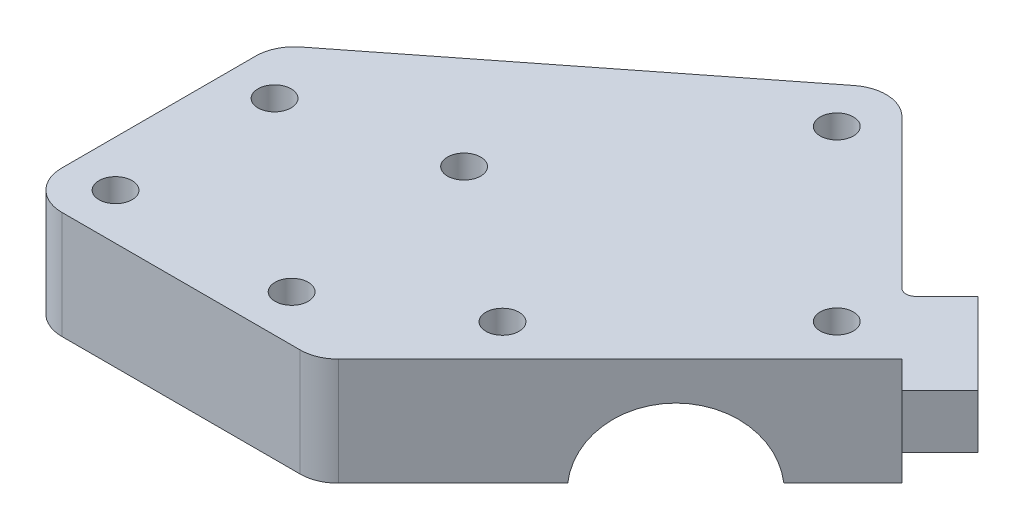
ISO-10303-21;
HEADER;
FILE_DESCRIPTION(('STEP AP214'),'2;1');
FILE_NAME('part.step','',(''),(''),'','','');
FILE_SCHEMA(('AUTOMOTIVE_DESIGN { 1 0 10303 214 1 1 1 1 }'));
ENDSEC;
DATA;
#1=APPLICATION_CONTEXT('core data for automotive mechanical design processes');
#2=APPLICATION_PROTOCOL_DEFINITION('international standard','automotive_design',2000,#1);
#3=PRODUCT_CONTEXT('',#1,'mechanical');
#4=PRODUCT('Part','Part','',(#3));
#5=PRODUCT_RELATED_PRODUCT_CATEGORY('part','',(#4));
#6=PRODUCT_DEFINITION_FORMATION('','',#4);
#7=PRODUCT_DEFINITION_CONTEXT('part definition',#1,'design');
#8=PRODUCT_DEFINITION('design','',#6,#7);
#9=PRODUCT_DEFINITION_SHAPE('','',#8);
#10=(LENGTH_UNIT() NAMED_UNIT(*) SI_UNIT(.MILLI.,.METRE.));
#11=(NAMED_UNIT(*) PLANE_ANGLE_UNIT() SI_UNIT($,.RADIAN.));
#12=(NAMED_UNIT(*) SI_UNIT($,.STERADIAN.) SOLID_ANGLE_UNIT());
#13=UNCERTAINTY_MEASURE_WITH_UNIT(LENGTH_MEASURE(1.E-05),#10,'distance_accuracy_value','');
#14=(GEOMETRIC_REPRESENTATION_CONTEXT(3) GLOBAL_UNCERTAINTY_ASSIGNED_CONTEXT((#13)) GLOBAL_UNIT_ASSIGNED_CONTEXT((#10,
#11,#12)) REPRESENTATION_CONTEXT('',''));
#15=CARTESIAN_POINT('',(0.,0.,0.));
#16=DIRECTION('',(0.,0.,1.));
#17=DIRECTION('',(1.,0.,0.));
#18=AXIS2_PLACEMENT_3D('',#15,#16,#17);
#19=CARTESIAN_POINT('',(0.,15.,0.));
#20=DIRECTION('',(0.,-1.,0.));
#21=DIRECTION('',(0.,0.,-1.));
#22=AXIS2_PLACEMENT_3D('',#19,#20,#21);
#23=PLANE('',#22);
#24=CARTESIAN_POINT('',(-35.0289321881345,15.,10.35));
#25=DIRECTION('',(0.,1.,0.));
#26=DIRECTION('',(0.,0.,1.));
#27=AXIS2_PLACEMENT_3D('',#24,#25,#26);
#28=CIRCLE('',#27,2.15899999999999);
#29=CARTESIAN_POINT('',(-35.0289321881345,15.,12.509));
#30=VERTEX_POINT('',#29);
#31=EDGE_CURVE('E459',#30,#30,#28,.T.);
#32=ORIENTED_EDGE('',*,*,#31,.F.);
#33=EDGE_LOOP('',(#32));
#34=FACE_BOUND('',#33,.T.);
#35=CARTESIAN_POINT('',(5.,15.,0.));
#36=DIRECTION('',(0.,1.,0.));
#37=DIRECTION('',(0.,0.,1.));
#38=AXIS2_PLACEMENT_3D('',#35,#36,#37);
#39=CIRCLE('',#38,2.15899999999999);
#40=CARTESIAN_POINT('',(5.,15.,2.15899999999999));
#41=VERTEX_POINT('',#40);
#42=EDGE_CURVE('E451',#41,#41,#39,.T.);
#43=ORIENTED_EDGE('',*,*,#42,.F.);
#44=EDGE_LOOP('',(#43));
#45=FACE_BOUND('',#44,.T.);
#46=CARTESIAN_POINT('',(-15.,15.,-15.));
#47=DIRECTION('',(0.,1.,0.));
#48=DIRECTION('',(0.,0.,1.));
#49=AXIS2_PLACEMENT_3D('',#46,#47,#48);
#50=CIRCLE('',#49,2.15899999999999);
#51=CARTESIAN_POINT('',(-15.,15.,-12.841));
#52=VERTEX_POINT('',#51);
#53=EDGE_CURVE('E443',#52,#52,#50,.T.);
#54=ORIENTED_EDGE('',*,*,#53,.F.);
#55=EDGE_LOOP('',(#54));
#56=FACE_BOUND('',#55,.T.);
#57=CARTESIAN_POINT('',(-12.1030431086579,15.,10.35));
#58=DIRECTION('',(0.,1.,0.));
#59=DIRECTION('',(0.,0.,1.));
#60=AXIS2_PLACEMENT_3D('',#57,#58,#59);
#61=CIRCLE('',#60,2.15899999999999);
#62=CARTESIAN_POINT('',(-12.1030431086579,15.,12.509));
#63=VERTEX_POINT('',#62);
#64=EDGE_CURVE('E435',#63,#63,#61,.T.);
#65=ORIENTED_EDGE('',*,*,#64,.F.);
#66=EDGE_LOOP('',(#65));
#67=FACE_BOUND('',#66,.T.);
#68=CARTESIAN_POINT('',(-35.0289321881345,15.,-10.35));
#69=DIRECTION('',(0.,1.,0.));
#70=DIRECTION('',(0.,0.,1.));
#71=AXIS2_PLACEMENT_3D('',#68,#69,#70);
#72=CIRCLE('',#71,2.15899999999999);
#73=CARTESIAN_POINT('',(-35.0289321881345,15.,-8.19100000000001));
#74=VERTEX_POINT('',#73);
#75=EDGE_CURVE('E427',#74,#74,#72,.T.);
#76=ORIENTED_EDGE('',*,*,#75,.F.);
#77=EDGE_LOOP('',(#76));
#78=FACE_BOUND('',#77,.T.);
#79=CARTESIAN_POINT('',(4.74345339314418,15.,-43.7897087453206));
#80=DIRECTION('',(0.,1.,0.));
#81=DIRECTION('',(0.,0.,1.));
#82=AXIS2_PLACEMENT_3D('',#79,#80,#81);
#83=CIRCLE('',#82,2.15899999999999);
#84=CARTESIAN_POINT('',(4.74345339314418,15.,-41.6307087453206));
#85=VERTEX_POINT('',#84);
#86=EDGE_CURVE('E419',#85,#85,#83,.T.);
#87=ORIENTED_EDGE('',*,*,#86,.F.);
#88=EDGE_LOOP('',(#87));
#89=FACE_BOUND('',#88,.T.);
#90=DIRECTION('',(-1.,0.,0.));
#91=VECTOR('',#90,1.);
#92=CARTESIAN_POINT('',(-2.92893218813456,15.,16.35));
#93=LINE('',#92,#91);
#94=CARTESIAN_POINT('',(-5.00000000000003,15.,16.35));
#95=VERTEX_POINT('',#94);
#96=CARTESIAN_POINT('',(-36.0289321881345,15.,16.35));
#97=VERTEX_POINT('',#96);
#98=EDGE_CURVE('E270',#95,#97,#93,.T.);
#99=ORIENTED_EDGE('',*,*,#98,.F.);
#100=CARTESIAN_POINT('',(-5.00000000000003,15.,11.35));
#101=DIRECTION('',(0.,-1.,0.));
#102=DIRECTION('',(0.,0.,-1.));
#103=AXIS2_PLACEMENT_3D('',#100,#101,#102);
#104=CIRCLE('',#103,5.);
#105=CARTESIAN_POINT('',(-1.46446609406729,15.,14.8855339059327));
#106=VERTEX_POINT('',#105);
#107=EDGE_CURVE('E334',#95,#106,#104,.F.);
#108=ORIENTED_EDGE('',*,*,#107,.T.);
#109=DIRECTION('',(-0.707106781186548,0.,0.707106781186547));
#110=VECTOR('',#109,1.);
#111=CARTESIAN_POINT('',(35.2197556622844,15.,-21.7986878504189));
#112=LINE('',#111,#110);
#113=CARTESIAN_POINT('',(35.2197556622844,15.,-21.7986878504188));
#114=VERTEX_POINT('',#113);
#115=EDGE_CURVE('E266',#114,#106,#112,.T.);
#116=ORIENTED_EDGE('',*,*,#115,.F.);
#117=DIRECTION('',(0.707106781186547,0.,0.707106781186547));
#118=VECTOR('',#117,1.);
#119=CARTESIAN_POINT('',(35.2197556622843,15.,-21.7986878504189));
#120=LINE('',#119,#118);
#121=CARTESIAN_POINT('',(38.755289568217,15.,-18.2631539444862));
#122=VERTEX_POINT('',#121);
#123=EDGE_CURVE('E214',#114,#122,#120,.T.);
#124=ORIENTED_EDGE('',*,*,#123,.T.);
#125=DIRECTION('',(0.707106781186547,0.,-0.707106781186548));
#126=VECTOR('',#125,1.);
#127=CARTESIAN_POINT('',(38.755289568217,15.,-18.2631539444862));
#128=LINE('',#127,#126);
#129=CARTESIAN_POINT('',(43.7050370365229,15.,-23.2129014127921));
#130=VERTEX_POINT('',#129);
#131=EDGE_CURVE('E237',#122,#130,#128,.T.);
#132=ORIENTED_EDGE('',*,*,#131,.T.);
#133=DIRECTION('',(-0.707106781186547,0.,-0.707106781186548));
#134=VECTOR('',#133,1.);
#135=CARTESIAN_POINT('',(43.7050370365229,15.,-23.2129014127921));
#136=LINE('',#135,#134);
#137=CARTESIAN_POINT('',(33.0984353187248,15.,-33.8195031305902));
#138=VERTEX_POINT('',#137);
#139=EDGE_CURVE('E241',#130,#138,#136,.T.);
#140=ORIENTED_EDGE('',*,*,#139,.T.);
#141=DIRECTION('',(-0.707106781186547,0.,0.707106781186548));
#142=VECTOR('',#141,1.);
#143=CARTESIAN_POINT('',(33.0984353187248,15.,-33.8195031305902));
#144=LINE('',#143,#142);
#145=CARTESIAN_POINT('',(29.0467134625259,15.,-29.7677812743913));
#146=VERTEX_POINT('',#145);
#147=EDGE_CURVE('E222',#138,#146,#144,.T.);
#148=ORIENTED_EDGE('',*,*,#147,.T.);
#149=CARTESIAN_POINT('',(28.148687850419,15.,-30.6658068864982));
#150=DIRECTION('',(0.,-1.,0.));
#151=DIRECTION('',(0.,0.,-1.));
#152=AXIS2_PLACEMENT_3D('',#149,#150,#151);
#153=CIRCLE('',#152,1.27);
#154=CARTESIAN_POINT('',(27.250662238312,15.,-29.7677812743913));
#155=VERTEX_POINT('',#154);
#156=EDGE_CURVE('E361',#146,#155,#153,.T.);
#157=ORIENTED_EDGE('',*,*,#156,.T.);
#158=DIRECTION('',(0.707106781186547,0.,0.707106781186548));
#159=VECTOR('',#158,1.);
#160=CARTESIAN_POINT('',(4.74345339314427,15.,-52.2749901195591));
#161=LINE('',#160,#159);
#162=CARTESIAN_POINT('',(7.87842234948687,15.,-49.1400211632165));
#163=VERTEX_POINT('',#162);
#164=EDGE_CURVE('E262',#163,#155,#161,.T.);
#165=ORIENTED_EDGE('',*,*,#164,.F.);
#166=CARTESIAN_POINT('',(4.34288844355414,15.,-45.6044872572837));
#167=DIRECTION('',(0.,-1.,0.));
#168=DIRECTION('',(0.,0.,-1.));
#169=AXIS2_PLACEMENT_3D('',#166,#167,#168);
#170=CIRCLE('',#169,5.);
#171=CARTESIAN_POINT('',(1.25585463277242,15.,-49.5377075983135));
#172=VERTEX_POINT('',#171);
#173=EDGE_CURVE('E325',#163,#172,#170,.F.);
#174=ORIENTED_EDGE('',*,*,#173,.T.);
#175=DIRECTION('',(0.78664406820596,0.,-0.617406762156341));
#176=VECTOR('',#175,1.);
#177=CARTESIAN_POINT('',(-41.0289321881345,15.,-16.3499999999999));
#178=LINE('',#177,#176);
#179=CARTESIAN_POINT('',(-39.1159659989162,15.,-17.8514138016617));
#180=VERTEX_POINT('',#179);
#181=EDGE_CURVE('E258',#180,#172,#178,.T.);
#182=ORIENTED_EDGE('',*,*,#181,.F.);
#183=CARTESIAN_POINT('',(-36.0289321881345,15.,-13.9181934606319));
#184=DIRECTION('',(0.,-1.,0.));
#185=DIRECTION('',(0.,0.,-1.));
#186=AXIS2_PLACEMENT_3D('',#183,#184,#185);
#187=CIRCLE('',#186,5.);
#188=CARTESIAN_POINT('',(-41.0289321881345,15.,-13.9181934606319));
#189=VERTEX_POINT('',#188);
#190=EDGE_CURVE('E328',#180,#189,#187,.F.);
#191=ORIENTED_EDGE('',*,*,#190,.T.);
#192=DIRECTION('',(0.,0.,-1.));
#193=VECTOR('',#192,1.);
#194=CARTESIAN_POINT('',(-41.0289321881345,15.,16.35));
#195=LINE('',#194,#193);
#196=CARTESIAN_POINT('',(-41.0289321881345,15.,11.35));
#197=VERTEX_POINT('',#196);
#198=EDGE_CURVE('E274',#197,#189,#195,.T.);
#199=ORIENTED_EDGE('',*,*,#198,.F.);
#200=CARTESIAN_POINT('',(-36.0289321881345,15.,11.35));
#201=DIRECTION('',(0.,-1.,0.));
#202=DIRECTION('',(0.,0.,-1.));
#203=AXIS2_PLACEMENT_3D('',#200,#201,#202);
#204=CIRCLE('',#203,5.);
#205=EDGE_CURVE('E331',#197,#97,#204,.F.);
#206=ORIENTED_EDGE('',*,*,#205,.T.);
#207=EDGE_LOOP('',(#99,#108,#116,#124,#132,#140,#148,#157,#165,#174,#182,#191,#199,#206));
#208=FACE_BOUND('',#207,.T.);
#209=CARTESIAN_POINT('',(26.7344742880458,15.,-21.7986878504189));
#210=DIRECTION('',(0.,1.,0.));
#211=DIRECTION('',(0.,0.,1.));
#212=AXIS2_PLACEMENT_3D('',#209,#210,#211);
#213=CIRCLE('',#212,2.15899999999999);
#214=CARTESIAN_POINT('',(26.7344742880458,15.,-19.6396878504189));
#215=VERTEX_POINT('',#214);
#216=EDGE_CURVE('E407',#215,#215,#213,.T.);
#217=ORIENTED_EDGE('',*,*,#216,.F.);
#218=EDGE_LOOP('',(#217));
#219=FACE_BOUND('',#218,.T.);
#220=ADVANCED_FACE('F39',(#34,#45,#56,#67,#78,#89,#208,#219),#23,.F.);
#221=CARTESIAN_POINT('',(-41.0289321881345,15.,-16.3499999999999));
#222=DIRECTION('',(-0.617406762156341,0.,-0.78664406820596));
#223=DIRECTION('',(-0.78664406820596,0.,0.617406762156341));
#224=AXIS2_PLACEMENT_3D('',#221,#222,#223);
#225=PLANE('',#224);
#226=DIRECTION('',(0.78664406820596,0.,-0.617406762156341));
#227=VECTOR('',#226,1.);
#228=CARTESIAN_POINT('',(-41.0289321881345,1.,-16.3499999999999));
#229=LINE('',#228,#227);
#230=CARTESIAN_POINT('',(-39.1159659989162,1.,-17.8514138016617));
#231=VERTEX_POINT('',#230);
#232=CARTESIAN_POINT('',(1.25585463277242,1.,-49.5377075983135));
#233=VERTEX_POINT('',#232);
#234=EDGE_CURVE('E251',#231,#233,#229,.T.);
#235=ORIENTED_EDGE('',*,*,#234,.F.);
#236=DIRECTION('',(0.,-1.,0.));
#237=VECTOR('',#236,1.);
#238=CARTESIAN_POINT('',(-39.1159659989162,15.,-17.8514138016617));
#239=LINE('',#238,#237);
#240=EDGE_CURVE('E348',#231,#180,#239,.F.);
#241=ORIENTED_EDGE('',*,*,#240,.T.);
#242=ORIENTED_EDGE('',*,*,#181,.T.);
#243=DIRECTION('',(0.,-1.,0.));
#244=VECTOR('',#243,1.);
#245=CARTESIAN_POINT('',(1.25585463277243,15.,-49.5377075983135));
#246=LINE('',#245,#244);
#247=EDGE_CURVE('E344',#172,#233,#246,.T.);
#248=ORIENTED_EDGE('',*,*,#247,.T.);
#249=EDGE_LOOP('',(#235,#241,#242,#248));
#250=FACE_BOUND('',#249,.T.);
#251=ADVANCED_FACE('F468',(#250),#225,.T.);
#252=CARTESIAN_POINT('',(-41.0289321881345,15.,16.35));
#253=DIRECTION('',(-1.,0.,0.));
#254=DIRECTION('',(0.,0.,1.));
#255=AXIS2_PLACEMENT_3D('',#252,#253,#254);
#256=PLANE('',#255);
#257=DIRECTION('',(0.,0.,-1.));
#258=VECTOR('',#257,1.);
#259=CARTESIAN_POINT('',(-41.0289321881345,1.,16.35));
#260=LINE('',#259,#258);
#261=CARTESIAN_POINT('',(-41.0289321881345,1.,11.35));
#262=VERTEX_POINT('',#261);
#263=CARTESIAN_POINT('',(-41.0289321881345,0.999999999999998,5.57950001493336));
#264=VERTEX_POINT('',#263);
#265=EDGE_CURVE('E193',#262,#264,#260,.T.);
#266=ORIENTED_EDGE('',*,*,#265,.F.);
#267=DIRECTION('',(0.,-1.,0.));
#268=VECTOR('',#267,1.);
#269=CARTESIAN_POINT('',(-41.0289321881345,15.,11.35));
#270=LINE('',#269,#268);
#271=EDGE_CURVE('E341',#262,#197,#270,.F.);
#272=ORIENTED_EDGE('',*,*,#271,.T.);
#273=ORIENTED_EDGE('',*,*,#198,.T.);
#274=DIRECTION('',(0.,-1.,0.));
#275=VECTOR('',#274,1.);
#276=CARTESIAN_POINT('',(-41.0289321881345,15.,-13.9181934606319));
#277=LINE('',#276,#275);
#278=CARTESIAN_POINT('',(-41.0289321881345,1.,-13.9181934606319));
#279=VERTEX_POINT('',#278);
#280=EDGE_CURVE('E337',#189,#279,#277,.T.);
#281=ORIENTED_EDGE('',*,*,#280,.T.);
#282=CARTESIAN_POINT('',(-41.0289321881345,0.999999999999998,-6.27076550350907));
#283=VERTEX_POINT('',#282);
#284=EDGE_CURVE('E295',#283,#279,#260,.T.);
#285=ORIENTED_EDGE('',*,*,#284,.F.);
#286=CARTESIAN_POINT('',(-41.0289321881345,0.0551181102362129,-0.345632744287855));
#287=DIRECTION('',(-1.,0.,0.));
#288=DIRECTION('',(0.,0.,1.));
#289=AXIS2_PLACEMENT_3D('',#286,#287,#288);
#290=CIRCLE('',#289,6.);
#291=EDGE_CURVE('E184',#264,#283,#290,.T.);
#292=ORIENTED_EDGE('',*,*,#291,.F.);
#293=EDGE_LOOP('',(#266,#272,#273,#281,#285,#292));
#294=FACE_BOUND('',#293,.T.);
#295=ADVANCED_FACE('F401',(#294),#256,.T.);
#296=CARTESIAN_POINT('',(-2.92893218813456,15.,16.35));
#297=DIRECTION('',(0.,0.,1.));
#298=DIRECTION('',(1.,0.,0.));
#299=AXIS2_PLACEMENT_3D('',#296,#297,#298);
#300=PLANE('',#299);
#301=DIRECTION('',(-1.,0.,0.));
#302=VECTOR('',#301,1.);
#303=CARTESIAN_POINT('',(-2.92893218813456,1.,16.35));
#304=LINE('',#303,#302);
#305=CARTESIAN_POINT('',(-5.00000000000003,1.,16.35));
#306=VERTEX_POINT('',#305);
#307=CARTESIAN_POINT('',(-36.0289321881345,1.,16.35));
#308=VERTEX_POINT('',#307);
#309=EDGE_CURVE('E291',#306,#308,#304,.T.);
#310=ORIENTED_EDGE('',*,*,#309,.F.);
#311=DIRECTION('',(0.,-1.,0.));
#312=VECTOR('',#311,1.);
#313=CARTESIAN_POINT('',(-5.00000000000003,15.,16.35));
#314=LINE('',#313,#312);
#315=EDGE_CURVE('E322',#306,#95,#314,.F.);
#316=ORIENTED_EDGE('',*,*,#315,.T.);
#317=ORIENTED_EDGE('',*,*,#98,.T.);
#318=DIRECTION('',(0.,-1.,0.));
#319=VECTOR('',#318,1.);
#320=CARTESIAN_POINT('',(-36.0289321881345,15.,16.35));
#321=LINE('',#320,#319);
#322=EDGE_CURVE('E318',#97,#308,#321,.T.);
#323=ORIENTED_EDGE('',*,*,#322,.T.);
#324=EDGE_LOOP('',(#310,#316,#317,#323));
#325=FACE_BOUND('',#324,.T.);
#326=ADVANCED_FACE('F391',(#325),#300,.T.);
#327=CARTESIAN_POINT('',(35.2197556622844,15.,-21.7986878504189));
#328=DIRECTION('',(0.707106781186547,0.,0.707106781186548));
#329=DIRECTION('',(0.707106781186548,0.,-0.707106781186547));
#330=AXIS2_PLACEMENT_3D('',#327,#328,#329);
#331=PLANE('',#330);
#332=ORIENTED_EDGE('',*,*,#115,.T.);
#333=DIRECTION('',(0.,-1.,0.));
#334=VECTOR('',#333,1.);
#335=CARTESIAN_POINT('',(-1.46446609406729,15.,14.8855339059327));
#336=LINE('',#335,#334);
#337=CARTESIAN_POINT('',(-1.46446609406729,1.,14.8855339059327));
#338=VERTEX_POINT('',#337);
#339=EDGE_CURVE('E302',#106,#338,#336,.T.);
#340=ORIENTED_EDGE('',*,*,#339,.T.);
#341=DIRECTION('',(-0.707106781186548,0.,0.707106781186547));
#342=VECTOR('',#341,1.);
#343=CARTESIAN_POINT('',(35.2197556622844,1.,-21.7986878504189));
#344=LINE('',#343,#342);
#345=CARTESIAN_POINT('',(13.4550962518595,0.999999999999969,-0.0340284399940839));
#346=VERTEX_POINT('',#345);
#347=EDGE_CURVE('E286',#346,#338,#344,.T.);
#348=ORIENTED_EDGE('',*,*,#347,.F.);
#349=CARTESIAN_POINT('',(20.4934883963605,0.0397541770692887,-7.07242058449499));
#350=DIRECTION('',(0.707106781186547,0.,0.707106781186548));
#351=DIRECTION('',(0.707106781186548,0.,-0.707106781186547));
#352=AXIS2_PLACEMENT_3D('',#349,#350,#351);
#353=CIRCLE('',#352,10.);
#354=CARTESIAN_POINT('',(27.5318805408614,0.999999999999969,-14.1108127289959));
#355=VERTEX_POINT('',#354);
#356=EDGE_CURVE('E195',#355,#346,#353,.T.);
#357=ORIENTED_EDGE('',*,*,#356,.F.);
#358=CARTESIAN_POINT('',(35.2197556622844,1.,-21.7986878504189));
#359=VERTEX_POINT('',#358);
#360=EDGE_CURVE('E287',#359,#355,#344,.T.);
#361=ORIENTED_EDGE('',*,*,#360,.F.);
#362=DIRECTION('',(0.,-1.,0.));
#363=VECTOR('',#362,1.);
#364=CARTESIAN_POINT('',(35.2197556622844,15.,-21.7986878504189));
#365=LINE('',#364,#363);
#366=CARTESIAN_POINT('',(35.2197556622844,6.73,-21.7986878504189));
#367=VERTEX_POINT('',#366);
#368=EDGE_CURVE('E278',#367,#359,#365,.T.);
#369=ORIENTED_EDGE('',*,*,#368,.F.);
#370=CARTESIAN_POINT('',(36.1177812743913,6.73,-22.6967134625258));
#371=DIRECTION('',(0.707106781186547,0.,0.707106781186548));
#372=DIRECTION('',(0.707106781186548,0.,-0.707106781186547));
#373=AXIS2_PLACEMENT_3D('',#370,#371,#372);
#374=CIRCLE('',#373,1.27);
#375=CARTESIAN_POINT('',(36.1177812743913,8.,-22.6967134625258));
#376=VERTEX_POINT('',#375);
#377=EDGE_CURVE('E48',#367,#376,#374,.F.);
#378=ORIENTED_EDGE('',*,*,#377,.T.);
#379=DIRECTION('',(0.707106781186548,0.,-0.707106781186547));
#380=VECTOR('',#379,1.);
#381=CARTESIAN_POINT('',(6.71053390593272,8.,6.71053390593273));
#382=LINE('',#381,#380);
#383=CARTESIAN_POINT('',(35.2197556622844,8.,-21.7986878504189));
#384=VERTEX_POINT('',#383);
#385=EDGE_CURVE('E55',#384,#376,#382,.T.);
#386=ORIENTED_EDGE('',*,*,#385,.F.);
#387=EDGE_CURVE('E298',#114,#384,#365,.T.);
#388=ORIENTED_EDGE('',*,*,#387,.F.);
#389=EDGE_LOOP('',(#332,#340,#348,#357,#361,#369,#378,#386,#388));
#390=FACE_BOUND('',#389,.T.);
#391=ADVANCED_FACE('F382',(#390),#331,.T.);
#392=CARTESIAN_POINT('',(4.74345339314427,15.,-52.2749901195591));
#393=DIRECTION('',(0.707106781186548,0.,-0.707106781186547));
#394=DIRECTION('',(-0.707106781186547,0.,-0.707106781186548));
#395=AXIS2_PLACEMENT_3D('',#392,#393,#394);
#396=PLANE('',#395);
#397=DIRECTION('',(0.,1.,0.));
#398=VECTOR('',#397,1.);
#399=CARTESIAN_POINT('',(27.250662238312,8.,-29.7677812743913));
#400=LINE('',#399,#398);
#401=CARTESIAN_POINT('',(27.250662238312,6.73,-29.7677812743913));
#402=VERTEX_POINT('',#401);
#403=EDGE_CURVE('E358',#155,#402,#400,.F.);
#404=ORIENTED_EDGE('',*,*,#403,.T.);
#405=DIRECTION('',(0.707106781186547,0.,0.707106781186548));
#406=VECTOR('',#405,1.);
#407=CARTESIAN_POINT('',(4.74345339314427,6.73,-52.2749901195591));
#408=LINE('',#407,#406);
#409=EDGE_CURVE('E364',#402,#367,#408,.T.);
#410=ORIENTED_EDGE('',*,*,#409,.T.);
#411=ORIENTED_EDGE('',*,*,#368,.T.);
#412=DIRECTION('',(0.707106781186547,0.,0.707106781186548));
#413=VECTOR('',#412,1.);
#414=CARTESIAN_POINT('',(4.74345339314427,1.,-52.2749901195591));
#415=LINE('',#414,#413);
#416=CARTESIAN_POINT('',(7.87842234948687,1.,-49.1400211632165));
#417=VERTEX_POINT('',#416);
#418=EDGE_CURVE('E282',#417,#359,#415,.T.);
#419=ORIENTED_EDGE('',*,*,#418,.F.);
#420=DIRECTION('',(0.,-1.,0.));
#421=VECTOR('',#420,1.);
#422=CARTESIAN_POINT('',(7.87842234948687,15.,-49.1400211632165));
#423=LINE('',#422,#421);
#424=EDGE_CURVE('E351',#417,#163,#423,.F.);
#425=ORIENTED_EDGE('',*,*,#424,.T.);
#426=ORIENTED_EDGE('',*,*,#164,.T.);
#427=EDGE_LOOP('',(#404,#410,#411,#419,#425,#426));
#428=FACE_BOUND('',#427,.T.);
#429=ADVANCED_FACE('F532',(#428),#396,.T.);
#430=CARTESIAN_POINT('',(0.,1.,0.));
#431=DIRECTION('',(0.,-1.,0.));
#432=DIRECTION('',(0.,0.,-1.));
#433=AXIS2_PLACEMENT_3D('',#430,#431,#432);
#434=PLANE('',#433);
#435=CARTESIAN_POINT('',(-35.0289321881345,0.999999999999973,10.35));
#436=DIRECTION('',(0.,1.,0.));
#437=DIRECTION('',(0.,0.,1.));
#438=AXIS2_PLACEMENT_3D('',#435,#436,#437);
#439=CIRCLE('',#438,2.15899999999999);
#440=CARTESIAN_POINT('',(-35.0289321881345,0.999999999999973,12.509));
#441=VERTEX_POINT('',#440);
#442=EDGE_CURVE('E455',#441,#441,#439,.T.);
#443=ORIENTED_EDGE('',*,*,#442,.T.);
#444=EDGE_LOOP('',(#443));
#445=FACE_BOUND('',#444,.T.);
#446=CARTESIAN_POINT('',(5.,0.999999999999973,0.));
#447=DIRECTION('',(0.,1.,0.));
#448=DIRECTION('',(0.,0.,1.));
#449=AXIS2_PLACEMENT_3D('',#446,#447,#448);
#450=CIRCLE('',#449,2.15899999999999);
#451=CARTESIAN_POINT('',(5.,0.999999999999973,2.15899999999999));
#452=VERTEX_POINT('',#451);
#453=EDGE_CURVE('E447',#452,#452,#450,.T.);
#454=ORIENTED_EDGE('',*,*,#453,.T.);
#455=EDGE_LOOP('',(#454));
#456=FACE_BOUND('',#455,.T.);
#457=CARTESIAN_POINT('',(-15.,0.999999999999973,-15.));
#458=DIRECTION('',(0.,1.,0.));
#459=DIRECTION('',(0.,0.,1.));
#460=AXIS2_PLACEMENT_3D('',#457,#458,#459);
#461=CIRCLE('',#460,2.15899999999999);
#462=CARTESIAN_POINT('',(-15.,0.999999999999973,-12.841));
#463=VERTEX_POINT('',#462);
#464=EDGE_CURVE('E439',#463,#463,#461,.T.);
#465=ORIENTED_EDGE('',*,*,#464,.T.);
#466=EDGE_LOOP('',(#465));
#467=FACE_BOUND('',#466,.T.);
#468=CARTESIAN_POINT('',(-12.1030431086579,0.999999999999973,10.35));
#469=DIRECTION('',(0.,1.,0.));
#470=DIRECTION('',(0.,0.,1.));
#471=AXIS2_PLACEMENT_3D('',#468,#469,#470);
#472=CIRCLE('',#471,2.15899999999999);
#473=CARTESIAN_POINT('',(-12.1030431086579,0.999999999999973,12.509));
#474=VERTEX_POINT('',#473);
#475=EDGE_CURVE('E431',#474,#474,#472,.T.);
#476=ORIENTED_EDGE('',*,*,#475,.T.);
#477=EDGE_LOOP('',(#476));
#478=FACE_BOUND('',#477,.T.);
#479=CARTESIAN_POINT('',(-35.0289321881345,0.999999999999973,-10.35));
#480=DIRECTION('',(0.,1.,0.));
#481=DIRECTION('',(0.,0.,1.));
#482=AXIS2_PLACEMENT_3D('',#479,#480,#481);
#483=CIRCLE('',#482,2.15899999999999);
#484=CARTESIAN_POINT('',(-35.0289321881345,0.999999999999973,-8.19100000000001));
#485=VERTEX_POINT('',#484);
#486=EDGE_CURVE('E423',#485,#485,#483,.T.);
#487=ORIENTED_EDGE('',*,*,#486,.T.);
#488=EDGE_LOOP('',(#487));
#489=FACE_BOUND('',#488,.T.);
#490=CARTESIAN_POINT('',(4.74345339314418,0.999999999999973,-43.7897087453206));
#491=DIRECTION('',(0.,1.,0.));
#492=DIRECTION('',(0.,0.,1.));
#493=AXIS2_PLACEMENT_3D('',#490,#491,#492);
#494=CIRCLE('',#493,2.15899999999999);
#495=CARTESIAN_POINT('',(4.74345339314418,0.999999999999973,-41.6307087453206));
#496=VERTEX_POINT('',#495);
#497=EDGE_CURVE('E413',#496,#496,#494,.T.);
#498=ORIENTED_EDGE('',*,*,#497,.T.);
#499=EDGE_LOOP('',(#498));
#500=FACE_BOUND('',#499,.T.);
#501=CARTESIAN_POINT('',(26.7344742880458,0.999999999999973,-21.7986878504189));
#502=DIRECTION('',(0.,1.,0.));
#503=DIRECTION('',(0.,0.,1.));
#504=AXIS2_PLACEMENT_3D('',#501,#502,#503);
#505=CIRCLE('',#504,2.15899999999998);
#506=CARTESIAN_POINT('',(26.7344742880458,0.999999999999973,-19.6396878504189));
#507=VERTEX_POINT('',#506);
#508=EDGE_CURVE('E404',#507,#507,#505,.T.);
#509=ORIENTED_EDGE('',*,*,#508,.T.);
#510=EDGE_LOOP('',(#509));
#511=FACE_BOUND('',#510,.T.);
#512=ORIENTED_EDGE('',*,*,#347,.T.);
#513=CARTESIAN_POINT('',(-5.00000000000003,1.,11.35));
#514=DIRECTION('',(0.,-1.,0.));
#515=DIRECTION('',(0.,0.,-1.));
#516=AXIS2_PLACEMENT_3D('',#513,#514,#515);
#517=CIRCLE('',#516,5.);
#518=EDGE_CURVE('E315',#338,#306,#517,.T.);
#519=ORIENTED_EDGE('',*,*,#518,.T.);
#520=ORIENTED_EDGE('',*,*,#309,.T.);
#521=CARTESIAN_POINT('',(-36.0289321881345,1.,11.35));
#522=DIRECTION('',(0.,-1.,0.));
#523=DIRECTION('',(0.,0.,-1.));
#524=AXIS2_PLACEMENT_3D('',#521,#522,#523);
#525=CIRCLE('',#524,5.);
#526=EDGE_CURVE('E312',#308,#262,#525,.T.);
#527=ORIENTED_EDGE('',*,*,#526,.T.);
#528=ORIENTED_EDGE('',*,*,#265,.T.);
#529=DIRECTION('',(-1.,0.,0.));
#530=VECTOR('',#529,1.);
#531=CARTESIAN_POINT('',(0.,0.999999999999998,5.57950001493336));
#532=LINE('',#531,#530);
#533=CARTESIAN_POINT('',(0.,0.999999999999998,5.57950001493336));
#534=VERTEX_POINT('',#533);
#535=EDGE_CURVE('E176',#534,#264,#532,.T.);
#536=ORIENTED_EDGE('',*,*,#535,.F.);
#537=DIRECTION('',(0.,0.,1.));
#538=VECTOR('',#537,1.);
#539=CARTESIAN_POINT('',(0.,0.999999999999998,-6.27076550350907));
#540=LINE('',#539,#538);
#541=CARTESIAN_POINT('',(0.,1.,-6.27076550350907));
#542=VERTEX_POINT('',#541);
#543=EDGE_CURVE('E183',#542,#534,#540,.T.);
#544=ORIENTED_EDGE('',*,*,#543,.F.);
#545=DIRECTION('',(-1.,0.,0.));
#546=VECTOR('',#545,1.);
#547=CARTESIAN_POINT('',(0.,0.999999999999998,-6.27076550350907));
#548=LINE('',#547,#546);
#549=EDGE_CURVE('E179',#542,#283,#548,.T.);
#550=ORIENTED_EDGE('',*,*,#549,.T.);
#551=ORIENTED_EDGE('',*,*,#284,.T.);
#552=CARTESIAN_POINT('',(-36.0289321881345,1.,-13.9181934606319));
#553=DIRECTION('',(0.,-1.,0.));
#554=DIRECTION('',(0.,0.,-1.));
#555=AXIS2_PLACEMENT_3D('',#552,#553,#554);
#556=CIRCLE('',#555,5.);
#557=EDGE_CURVE('E309',#279,#231,#556,.T.);
#558=ORIENTED_EDGE('',*,*,#557,.T.);
#559=ORIENTED_EDGE('',*,*,#234,.T.);
#560=CARTESIAN_POINT('',(4.34288844355414,1.,-45.6044872572837));
#561=DIRECTION('',(0.,-1.,0.));
#562=DIRECTION('',(0.,0.,-1.));
#563=AXIS2_PLACEMENT_3D('',#560,#561,#562);
#564=CIRCLE('',#563,5.);
#565=EDGE_CURVE('E306',#233,#417,#564,.T.);
#566=ORIENTED_EDGE('',*,*,#565,.T.);
#567=ORIENTED_EDGE('',*,*,#418,.T.);
#568=ORIENTED_EDGE('',*,*,#360,.T.);
#569=DIRECTION('',(0.707106781186547,0.,0.707106781186548));
#570=VECTOR('',#569,1.);
#571=CARTESIAN_POINT('',(0.591112177653886,0.999999999999969,-41.0515810922034));
#572=LINE('',#571,#570);
#573=CARTESIAN_POINT('',(0.591112177653886,0.999999999999969,-41.0515810922034));
#574=VERTEX_POINT('',#573);
#575=EDGE_CURVE('E211',#574,#355,#572,.T.);
#576=ORIENTED_EDGE('',*,*,#575,.F.);
#577=DIRECTION('',(0.707106781186548,0.,-0.707106781186547));
#578=VECTOR('',#577,1.);
#579=CARTESIAN_POINT('',(-13.4856721113479,0.999999999999969,-26.9747968032016));
#580=LINE('',#579,#578);
#581=CARTESIAN_POINT('',(-13.4856721113479,1.,-26.9747968032016));
#582=VERTEX_POINT('',#581);
#583=EDGE_CURVE('E206',#582,#574,#580,.T.);
#584=ORIENTED_EDGE('',*,*,#583,.F.);
#585=DIRECTION('',(0.707106781186547,0.,0.707106781186548));
#586=VECTOR('',#585,1.);
#587=CARTESIAN_POINT('',(-13.4856721113479,0.999999999999969,-26.9747968032016));
#588=LINE('',#587,#586);
#589=EDGE_CURVE('E209',#582,#346,#588,.T.);
#590=ORIENTED_EDGE('',*,*,#589,.T.);
#591=EDGE_LOOP('',(#512,#519,#520,#527,#528,#536,#544,#550,#551,#558,#559,#566,#567,#568,#576,
#584,#590));
#592=FACE_BOUND('',#591,.T.);
#593=ADVANCED_FACE('F191',(#445,#456,#467,#478,#489,#500,#511,#592),#434,.T.);
#594=CARTESIAN_POINT('',(33.0984353187248,8.,-33.8195031305902));
#595=DIRECTION('',(-0.707106781186548,0.,-0.707106781186547));
#596=DIRECTION('',(-0.707106781186547,0.,0.707106781186548));
#597=AXIS2_PLACEMENT_3D('',#594,#595,#596);
#598=PLANE('',#597);
#599=DIRECTION('',(-0.707106781186547,0.,0.707106781186548));
#600=VECTOR('',#599,1.);
#601=CARTESIAN_POINT('',(33.0984353187248,8.,-33.8195031305902));
#602=LINE('',#601,#600);
#603=CARTESIAN_POINT('',(33.0984353187248,8.,-33.8195031305902));
#604=VERTEX_POINT('',#603);
#605=CARTESIAN_POINT('',(29.0467134625259,8.,-29.7677812743913));
#606=VERTEX_POINT('',#605);
#607=EDGE_CURVE('E230',#604,#606,#602,.T.);
#608=ORIENTED_EDGE('',*,*,#607,.T.);
#609=DIRECTION('',(0.,1.,0.));
#610=VECTOR('',#609,1.);
#611=CARTESIAN_POINT('',(29.0467134625259,15.,-29.7677812743913));
#612=LINE('',#611,#610);
#613=EDGE_CURVE('E354',#606,#146,#612,.T.);
#614=ORIENTED_EDGE('',*,*,#613,.T.);
#615=ORIENTED_EDGE('',*,*,#147,.F.);
#616=DIRECTION('',(0.,1.,0.));
#617=VECTOR('',#616,1.);
#618=CARTESIAN_POINT('',(33.0984353187248,8.,-33.8195031305902));
#619=LINE('',#618,#617);
#620=EDGE_CURVE('E248',#604,#138,#619,.T.);
#621=ORIENTED_EDGE('',*,*,#620,.F.);
#622=EDGE_LOOP('',(#608,#614,#615,#621));
#623=FACE_BOUND('',#622,.T.);
#624=ADVANCED_FACE('F515',(#623),#598,.T.);
#625=CARTESIAN_POINT('',(43.7050370365229,8.,-23.2129014127921));
#626=DIRECTION('',(0.707106781186548,0.,-0.707106781186547));
#627=DIRECTION('',(-0.707106781186547,0.,-0.707106781186548));
#628=AXIS2_PLACEMENT_3D('',#625,#626,#627);
#629=PLANE('',#628);
#630=ORIENTED_EDGE('',*,*,#139,.F.);
#631=DIRECTION('',(0.,1.,0.));
#632=VECTOR('',#631,1.);
#633=CARTESIAN_POINT('',(43.7050370365229,8.,-23.2129014127921));
#634=LINE('',#633,#632);
#635=CARTESIAN_POINT('',(43.7050370365229,8.,-23.2129014127921));
#636=VERTEX_POINT('',#635);
#637=EDGE_CURVE('E252',#636,#130,#634,.T.);
#638=ORIENTED_EDGE('',*,*,#637,.F.);
#639=DIRECTION('',(-0.707106781186547,0.,-0.707106781186548));
#640=VECTOR('',#639,1.);
#641=CARTESIAN_POINT('',(43.7050370365229,8.,-23.2129014127921));
#642=LINE('',#641,#640);
#643=EDGE_CURVE('E226',#636,#604,#642,.T.);
#644=ORIENTED_EDGE('',*,*,#643,.T.);
#645=ORIENTED_EDGE('',*,*,#620,.T.);
#646=EDGE_LOOP('',(#630,#638,#644,#645));
#647=FACE_BOUND('',#646,.T.);
#648=ADVANCED_FACE('F518',(#647),#629,.T.);
#649=CARTESIAN_POINT('',(38.755289568217,8.,-18.2631539444862));
#650=DIRECTION('',(0.707106781186548,0.,0.707106781186547));
#651=DIRECTION('',(0.707106781186547,0.,-0.707106781186548));
#652=AXIS2_PLACEMENT_3D('',#649,#650,#651);
#653=PLANE('',#652);
#654=ORIENTED_EDGE('',*,*,#131,.F.);
#655=DIRECTION('',(0.,1.,0.));
#656=VECTOR('',#655,1.);
#657=CARTESIAN_POINT('',(38.755289568217,8.,-18.2631539444862));
#658=LINE('',#657,#656);
#659=CARTESIAN_POINT('',(38.755289568217,8.,-18.2631539444862));
#660=VERTEX_POINT('',#659);
#661=EDGE_CURVE('E234',#660,#122,#658,.T.);
#662=ORIENTED_EDGE('',*,*,#661,.F.);
#663=DIRECTION('',(0.707106781186547,0.,-0.707106781186548));
#664=VECTOR('',#663,1.);
#665=CARTESIAN_POINT('',(38.755289568217,8.,-18.2631539444862));
#666=LINE('',#665,#664);
#667=EDGE_CURVE('E221',#660,#636,#666,.T.);
#668=ORIENTED_EDGE('',*,*,#667,.T.);
#669=ORIENTED_EDGE('',*,*,#637,.T.);
#670=EDGE_LOOP('',(#654,#662,#668,#669));
#671=FACE_BOUND('',#670,.T.);
#672=ADVANCED_FACE('F522',(#671),#653,.T.);
#673=CARTESIAN_POINT('',(35.2197556622843,8.,-21.7986878504189));
#674=DIRECTION('',(-0.707106781186548,0.,0.707106781186548));
#675=DIRECTION('',(0.707106781186548,0.,0.707106781186548));
#676=AXIS2_PLACEMENT_3D('',#673,#674,#675);
#677=PLANE('',#676);
#678=ORIENTED_EDGE('',*,*,#123,.F.);
#679=ORIENTED_EDGE('',*,*,#387,.T.);
#680=DIRECTION('',(0.707106781186543,0.,0.707106781186552));
#681=VECTOR('',#680,1.);
#682=CARTESIAN_POINT('',(28.1486878504189,8.,-28.8697556622843));
#683=LINE('',#682,#681);
#684=EDGE_CURVE('E218',#384,#660,#683,.T.);
#685=ORIENTED_EDGE('',*,*,#684,.T.);
#686=ORIENTED_EDGE('',*,*,#661,.T.);
#687=EDGE_LOOP('',(#678,#679,#685,#686));
#688=FACE_BOUND('',#687,.T.);
#689=ADVANCED_FACE('F513',(#688),#677,.T.);
#690=CARTESIAN_POINT('',(0.,8.,0.));
#691=DIRECTION('',(0.,1.,0.));
#692=DIRECTION('',(0.,0.,1.));
#693=AXIS2_PLACEMENT_3D('',#690,#691,#692);
#694=PLANE('',#693);
#695=ORIENTED_EDGE('',*,*,#684,.F.);
#696=ORIENTED_EDGE('',*,*,#385,.T.);
#697=DIRECTION('',(0.707106781186547,0.,0.707106781186548));
#698=VECTOR('',#697,1.);
#699=CARTESIAN_POINT('',(29.4072473684586,8.,-29.4072473684585));
#700=LINE('',#699,#698);
#701=EDGE_CURVE('E368',#376,#606,#700,.F.);
#702=ORIENTED_EDGE('',*,*,#701,.T.);
#703=ORIENTED_EDGE('',*,*,#607,.F.);
#704=ORIENTED_EDGE('',*,*,#643,.F.);
#705=ORIENTED_EDGE('',*,*,#667,.F.);
#706=EDGE_LOOP('',(#695,#696,#702,#703,#704,#705));
#707=FACE_BOUND('',#706,.T.);
#708=ADVANCED_FACE('F509',(#707),#694,.F.);
#709=CARTESIAN_POINT('',(-6.44727996684703,0.0397541770692887,-34.0131889477025));
#710=DIRECTION('',(0.707106781186547,0.,0.707106781186548));
#711=DIRECTION('',(0.707106781186548,0.,-0.707106781186547));
#712=AXIS2_PLACEMENT_3D('',#709,#710,#711);
#713=CYLINDRICAL_SURFACE('',#712,10.);
#714=ORIENTED_EDGE('',*,*,#356,.T.);
#715=ORIENTED_EDGE('',*,*,#589,.F.);
#716=CARTESIAN_POINT('',(-6.44727996684703,0.0397541770692887,-34.0131889477025));
#717=DIRECTION('',(0.707106781186547,0.,0.707106781186548));
#718=DIRECTION('',(0.707106781186548,0.,-0.707106781186547));
#719=AXIS2_PLACEMENT_3D('',#716,#717,#718);
#720=CIRCLE('',#719,10.);
#721=EDGE_CURVE('E199',#574,#582,#720,.T.);
#722=ORIENTED_EDGE('',*,*,#721,.F.);
#723=ORIENTED_EDGE('',*,*,#575,.T.);
#724=EDGE_LOOP('',(#714,#715,#722,#723));
#725=FACE_BOUND('',#724,.T.);
#726=ADVANCED_FACE('F505',(#725),#713,.F.);
#727=CARTESIAN_POINT('',(-6.44727996684703,0.0397541770692887,-34.0131889477025));
#728=DIRECTION('',(0.707106781186547,0.,0.707106781186548));
#729=DIRECTION('',(0.707106781186548,0.,-0.707106781186547));
#730=AXIS2_PLACEMENT_3D('',#727,#728,#729);
#731=PLANE('',#730);
#732=ORIENTED_EDGE('',*,*,#721,.T.);
#733=ORIENTED_EDGE('',*,*,#583,.T.);
#734=EDGE_LOOP('',(#732,#733));
#735=FACE_BOUND('',#734,.T.);
#736=ADVANCED_FACE('F502',(#735),#731,.T.);
#737=CARTESIAN_POINT('',(0.,0.0551181102362129,-0.345632744287855));
#738=DIRECTION('',(-1.,0.,0.));
#739=DIRECTION('',(0.,0.,1.));
#740=AXIS2_PLACEMENT_3D('',#737,#738,#739);
#741=CYLINDRICAL_SURFACE('',#740,6.);
#742=ORIENTED_EDGE('',*,*,#291,.T.);
#743=ORIENTED_EDGE('',*,*,#549,.F.);
#744=CARTESIAN_POINT('',(0.,0.0551181102362129,-0.345632744287855));
#745=DIRECTION('',(-1.,0.,0.));
#746=DIRECTION('',(0.,0.,1.));
#747=AXIS2_PLACEMENT_3D('',#744,#745,#746);
#748=CIRCLE('',#747,6.);
#749=EDGE_CURVE('E172',#534,#542,#748,.T.);
#750=ORIENTED_EDGE('',*,*,#749,.F.);
#751=ORIENTED_EDGE('',*,*,#535,.T.);
#752=EDGE_LOOP('',(#742,#743,#750,#751));
#753=FACE_BOUND('',#752,.T.);
#754=ADVANCED_FACE('F174',(#753),#741,.F.);
#755=CARTESIAN_POINT('',(0.,0.0551181102362129,-0.345632744287855));
#756=DIRECTION('',(-1.,0.,0.));
#757=DIRECTION('',(0.,0.,1.));
#758=AXIS2_PLACEMENT_3D('',#755,#756,#757);
#759=PLANE('',#758);
#760=ORIENTED_EDGE('',*,*,#749,.T.);
#761=ORIENTED_EDGE('',*,*,#543,.T.);
#762=EDGE_LOOP('',(#760,#761));
#763=FACE_BOUND('',#762,.T.);
#764=ADVANCED_FACE('F186',(#763),#759,.T.);
#765=CARTESIAN_POINT('',(26.7344742880458,15.,-21.7986878504189));
#766=DIRECTION('',(0.,1.,0.));
#767=DIRECTION('',(0.,0.,1.));
#768=AXIS2_PLACEMENT_3D('',#765,#766,#767);
#769=CYLINDRICAL_SURFACE('',#768,2.15899999999999);
#770=ORIENTED_EDGE('',*,*,#508,.F.);
#771=EDGE_LOOP('',(#770));
#772=FACE_BOUND('',#771,.T.);
#773=ORIENTED_EDGE('',*,*,#216,.T.);
#774=EDGE_LOOP('',(#773));
#775=FACE_BOUND('',#774,.T.);
#776=ADVANCED_FACE('F483',(#772,#775),#769,.F.);
#777=CARTESIAN_POINT('',(4.74345339314418,15.,-43.7897087453206));
#778=DIRECTION('',(0.,1.,0.));
#779=DIRECTION('',(0.,0.,1.));
#780=AXIS2_PLACEMENT_3D('',#777,#778,#779);
#781=CYLINDRICAL_SURFACE('',#780,2.15899999999999);
#782=ORIENTED_EDGE('',*,*,#497,.F.);
#783=EDGE_LOOP('',(#782));
#784=FACE_BOUND('',#783,.T.);
#785=ORIENTED_EDGE('',*,*,#86,.T.);
#786=EDGE_LOOP('',(#785));
#787=FACE_BOUND('',#786,.T.);
#788=ADVANCED_FACE('F480',(#784,#787),#781,.F.);
#789=CARTESIAN_POINT('',(-35.0289321881345,15.,-10.35));
#790=DIRECTION('',(0.,1.,0.));
#791=DIRECTION('',(0.,0.,1.));
#792=AXIS2_PLACEMENT_3D('',#789,#790,#791);
#793=CYLINDRICAL_SURFACE('',#792,2.15899999999999);
#794=ORIENTED_EDGE('',*,*,#486,.F.);
#795=EDGE_LOOP('',(#794));
#796=FACE_BOUND('',#795,.T.);
#797=ORIENTED_EDGE('',*,*,#75,.T.);
#798=EDGE_LOOP('',(#797));
#799=FACE_BOUND('',#798,.T.);
#800=ADVANCED_FACE('F482',(#796,#799),#793,.F.);
#801=CARTESIAN_POINT('',(-12.1030431086579,15.,10.35));
#802=DIRECTION('',(0.,1.,0.));
#803=DIRECTION('',(0.,0.,1.));
#804=AXIS2_PLACEMENT_3D('',#801,#802,#803);
#805=CYLINDRICAL_SURFACE('',#804,2.15899999999999);
#806=ORIENTED_EDGE('',*,*,#475,.F.);
#807=EDGE_LOOP('',(#806));
#808=FACE_BOUND('',#807,.T.);
#809=ORIENTED_EDGE('',*,*,#64,.T.);
#810=EDGE_LOOP('',(#809));
#811=FACE_BOUND('',#810,.T.);
#812=ADVANCED_FACE('F490',(#808,#811),#805,.F.);
#813=CARTESIAN_POINT('',(-15.,15.,-15.));
#814=DIRECTION('',(0.,1.,0.));
#815=DIRECTION('',(0.,0.,1.));
#816=AXIS2_PLACEMENT_3D('',#813,#814,#815);
#817=CYLINDRICAL_SURFACE('',#816,2.15899999999999);
#818=ORIENTED_EDGE('',*,*,#464,.F.);
#819=EDGE_LOOP('',(#818));
#820=FACE_BOUND('',#819,.T.);
#821=ORIENTED_EDGE('',*,*,#53,.T.);
#822=EDGE_LOOP('',(#821));
#823=FACE_BOUND('',#822,.T.);
#824=ADVANCED_FACE('F696',(#820,#823),#817,.F.);
#825=CARTESIAN_POINT('',(5.,15.,0.));
#826=DIRECTION('',(0.,1.,0.));
#827=DIRECTION('',(0.,0.,1.));
#828=AXIS2_PLACEMENT_3D('',#825,#826,#827);
#829=CYLINDRICAL_SURFACE('',#828,2.15899999999999);
#830=ORIENTED_EDGE('',*,*,#453,.F.);
#831=EDGE_LOOP('',(#830));
#832=FACE_BOUND('',#831,.T.);
#833=ORIENTED_EDGE('',*,*,#42,.T.);
#834=EDGE_LOOP('',(#833));
#835=FACE_BOUND('',#834,.T.);
#836=ADVANCED_FACE('F686',(#832,#835),#829,.F.);
#837=CARTESIAN_POINT('',(-35.0289321881345,15.,10.35));
#838=DIRECTION('',(0.,1.,0.));
#839=DIRECTION('',(0.,0.,1.));
#840=AXIS2_PLACEMENT_3D('',#837,#838,#839);
#841=CYLINDRICAL_SURFACE('',#840,2.15899999999999);
#842=ORIENTED_EDGE('',*,*,#442,.F.);
#843=EDGE_LOOP('',(#842));
#844=FACE_BOUND('',#843,.T.);
#845=ORIENTED_EDGE('',*,*,#31,.T.);
#846=EDGE_LOOP('',(#845));
#847=FACE_BOUND('',#846,.T.);
#848=ADVANCED_FACE('F464',(#844,#847),#841,.F.);
#849=CARTESIAN_POINT('',(-5.00000000000003,15.,11.35));
#850=DIRECTION('',(0.,-1.,0.));
#851=DIRECTION('',(0.,0.,-1.));
#852=AXIS2_PLACEMENT_3D('',#849,#850,#851);
#853=CYLINDRICAL_SURFACE('',#852,5.);
#854=ORIENTED_EDGE('',*,*,#107,.F.);
#855=ORIENTED_EDGE('',*,*,#315,.F.);
#856=ORIENTED_EDGE('',*,*,#518,.F.);
#857=ORIENTED_EDGE('',*,*,#339,.F.);
#858=EDGE_LOOP('',(#854,#855,#856,#857));
#859=FACE_BOUND('',#858,.T.);
#860=ADVANCED_FACE('F387',(#859),#853,.T.);
#861=CARTESIAN_POINT('',(-36.0289321881345,15.,11.35));
#862=DIRECTION('',(0.,-1.,0.));
#863=DIRECTION('',(0.,0.,-1.));
#864=AXIS2_PLACEMENT_3D('',#861,#862,#863);
#865=CYLINDRICAL_SURFACE('',#864,5.);
#866=ORIENTED_EDGE('',*,*,#205,.F.);
#867=ORIENTED_EDGE('',*,*,#271,.F.);
#868=ORIENTED_EDGE('',*,*,#526,.F.);
#869=ORIENTED_EDGE('',*,*,#322,.F.);
#870=EDGE_LOOP('',(#866,#867,#868,#869));
#871=FACE_BOUND('',#870,.T.);
#872=ADVANCED_FACE('F399',(#871),#865,.T.);
#873=CARTESIAN_POINT('',(-36.0289321881345,15.,-13.9181934606319));
#874=DIRECTION('',(0.,-1.,0.));
#875=DIRECTION('',(0.,0.,-1.));
#876=AXIS2_PLACEMENT_3D('',#873,#874,#875);
#877=CYLINDRICAL_SURFACE('',#876,5.);
#878=ORIENTED_EDGE('',*,*,#190,.F.);
#879=ORIENTED_EDGE('',*,*,#240,.F.);
#880=ORIENTED_EDGE('',*,*,#557,.F.);
#881=ORIENTED_EDGE('',*,*,#280,.F.);
#882=EDGE_LOOP('',(#878,#879,#880,#881));
#883=FACE_BOUND('',#882,.T.);
#884=ADVANCED_FACE('F550',(#883),#877,.T.);
#885=CARTESIAN_POINT('',(4.34288844355414,15.,-45.6044872572837));
#886=DIRECTION('',(0.,-1.,0.));
#887=DIRECTION('',(0.,0.,-1.));
#888=AXIS2_PLACEMENT_3D('',#885,#886,#887);
#889=CYLINDRICAL_SURFACE('',#888,5.);
#890=ORIENTED_EDGE('',*,*,#173,.F.);
#891=ORIENTED_EDGE('',*,*,#424,.F.);
#892=ORIENTED_EDGE('',*,*,#565,.F.);
#893=ORIENTED_EDGE('',*,*,#247,.F.);
#894=EDGE_LOOP('',(#890,#891,#892,#893));
#895=FACE_BOUND('',#894,.T.);
#896=ADVANCED_FACE('F553',(#895),#889,.T.);
#897=CARTESIAN_POINT('',(28.148687850419,8.,-30.6658068864982));
#898=DIRECTION('',(0.,-1.,0.));
#899=DIRECTION('',(0.,0.,-1.));
#900=AXIS2_PLACEMENT_3D('',#897,#898,#899);
#901=CYLINDRICAL_SURFACE('',#900,1.27);
#902=ORIENTED_EDGE('',*,*,#613,.F.);
#903=CARTESIAN_POINT('',(28.148687850419,6.73,-30.6658068864982));
#904=DIRECTION('',(0.5,-0.707106781186547,0.5));
#905=DIRECTION('',(-0.5,-0.707106781186547,-0.5));
#906=AXIS2_PLACEMENT_3D('',#903,#904,#905);
#907=ELLIPSE('',#906,1.79605122421383,1.27);
#908=EDGE_CURVE('E11',#606,#402,#907,.T.);
#909=ORIENTED_EDGE('',*,*,#908,.T.);
#910=ORIENTED_EDGE('',*,*,#403,.F.);
#911=ORIENTED_EDGE('',*,*,#156,.F.);
#912=EDGE_LOOP('',(#902,#909,#910,#911));
#913=FACE_BOUND('',#912,.T.);
#914=ADVANCED_FACE('F556',(#913),#901,.F.);
#915=CARTESIAN_POINT('',(5.64147900525119,6.73,-53.173015731666));
#916=DIRECTION('',(0.707106781186547,0.,0.707106781186548));
#917=DIRECTION('',(0.707106781186548,0.,-0.707106781186547));
#918=AXIS2_PLACEMENT_3D('',#915,#916,#917);
#919=CYLINDRICAL_SURFACE('',#918,1.27);
#920=ORIENTED_EDGE('',*,*,#908,.F.);
#921=ORIENTED_EDGE('',*,*,#701,.F.);
#922=ORIENTED_EDGE('',*,*,#377,.F.);
#923=ORIENTED_EDGE('',*,*,#409,.F.);
#924=EDGE_LOOP('',(#920,#921,#922,#923));
#925=FACE_BOUND('',#924,.T.);
#926=ADVANCED_FACE('F41',(#925),#919,.F.);
#927=CLOSED_SHELL('',(#220,#251,#295,#326,#391,#429,#593,#624,#648,#672,#689,#708,#726,#736,
#754,#764,#776,#788,#800,#812,#824,#836,#848,#860,#872,#884,#896,#914,#926));
#928=MANIFOLD_SOLID_BREP('B2',#927);
#929=ADVANCED_BREP_SHAPE_REPRESENTATION('',(#18,#928),#14);
#930=SHAPE_DEFINITION_REPRESENTATION(#9,#929);
ENDSEC;
END-ISO-10303-21;
